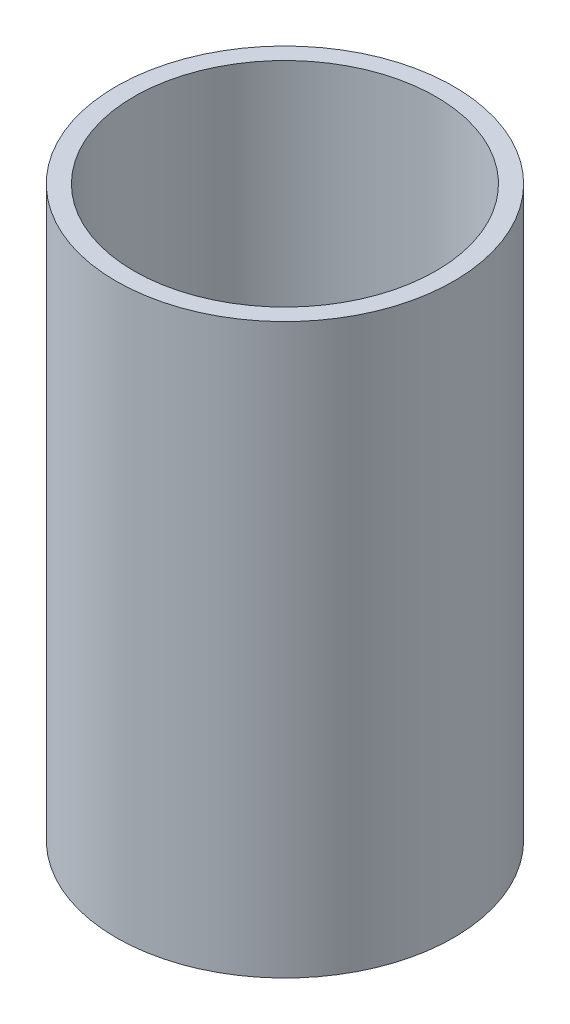
ISO-10303-21;
HEADER;
FILE_DESCRIPTION(('STEP AP214'),'2;1');
FILE_NAME('part.step','',(''),(''),'','','');
FILE_SCHEMA(('AUTOMOTIVE_DESIGN { 1 0 10303 214 1 1 1 1 }'));
ENDSEC;
DATA;
#1=APPLICATION_CONTEXT('core data for automotive mechanical design processes');
#2=APPLICATION_PROTOCOL_DEFINITION('international standard','automotive_design',2000,#1);
#3=PRODUCT_CONTEXT('',#1,'mechanical');
#4=PRODUCT('Part','Part','',(#3));
#5=PRODUCT_RELATED_PRODUCT_CATEGORY('part','',(#4));
#6=PRODUCT_DEFINITION_FORMATION('','',#4);
#7=PRODUCT_DEFINITION_CONTEXT('part definition',#1,'design');
#8=PRODUCT_DEFINITION('design','',#6,#7);
#9=PRODUCT_DEFINITION_SHAPE('','',#8);
#10=(LENGTH_UNIT() NAMED_UNIT(*) SI_UNIT(.MILLI.,.METRE.));
#11=(NAMED_UNIT(*) PLANE_ANGLE_UNIT() SI_UNIT($,.RADIAN.));
#12=(NAMED_UNIT(*) SI_UNIT($,.STERADIAN.) SOLID_ANGLE_UNIT());
#13=UNCERTAINTY_MEASURE_WITH_UNIT(LENGTH_MEASURE(1.E-05),#10,'distance_accuracy_value','');
#14=(GEOMETRIC_REPRESENTATION_CONTEXT(3) GLOBAL_UNCERTAINTY_ASSIGNED_CONTEXT((#13)) GLOBAL_UNIT_ASSIGNED_CONTEXT((#10,
#11,#12)) REPRESENTATION_CONTEXT('',''));
#15=CARTESIAN_POINT('',(0.,0.,0.));
#16=DIRECTION('',(0.,0.,1.));
#17=DIRECTION('',(1.,0.,0.));
#18=AXIS2_PLACEMENT_3D('',#15,#16,#17);
#19=CARTESIAN_POINT('',(0.,101.6,0.));
#20=DIRECTION('',(0.,1.,0.));
#21=DIRECTION('',(0.,0.,1.));
#22=AXIS2_PLACEMENT_3D('',#19,#20,#21);
#23=PLANE('',#22);
#24=CARTESIAN_POINT('',(0.,101.6,0.));
#25=DIRECTION('',(0.,1.,0.));
#26=DIRECTION('',(0.,0.,1.));
#27=AXIS2_PLACEMENT_3D('',#24,#25,#26);
#28=CIRCLE('',#27,30.1625);
#29=CARTESIAN_POINT('',(0.,101.6,30.1625));
#30=VERTEX_POINT('',#29);
#31=EDGE_CURVE('E10',#30,#30,#28,.T.);
#32=ORIENTED_EDGE('',*,*,#31,.T.);
#33=EDGE_LOOP('',(#32));
#34=FACE_BOUND('',#33,.T.);
#35=CARTESIAN_POINT('',(0.,101.6,0.));
#36=DIRECTION('',(0.,1.,0.));
#37=DIRECTION('',(0.,0.,1.));
#38=AXIS2_PLACEMENT_3D('',#35,#36,#37);
#39=CIRCLE('',#38,26.9875);
#40=CARTESIAN_POINT('',(0.,101.6,26.9875));
#41=VERTEX_POINT('',#40);
#42=EDGE_CURVE('E42',#41,#41,#39,.T.);
#43=ORIENTED_EDGE('',*,*,#42,.F.);
#44=EDGE_LOOP('',(#43));
#45=FACE_BOUND('',#44,.T.);
#46=ADVANCED_FACE('F31',(#34,#45),#23,.T.);
#47=CARTESIAN_POINT('',(0.,0.,0.));
#48=DIRECTION('',(0.,1.,0.));
#49=DIRECTION('',(0.,0.,1.));
#50=AXIS2_PLACEMENT_3D('',#47,#48,#49);
#51=PLANE('',#50);
#52=CARTESIAN_POINT('',(0.,0.,0.));
#53=DIRECTION('',(0.,1.,0.));
#54=DIRECTION('',(0.,0.,1.));
#55=AXIS2_PLACEMENT_3D('',#52,#53,#54);
#56=CIRCLE('',#55,30.1625);
#57=CARTESIAN_POINT('',(0.,0.,30.1625));
#58=VERTEX_POINT('',#57);
#59=EDGE_CURVE('E35',#58,#58,#56,.T.);
#60=ORIENTED_EDGE('',*,*,#59,.F.);
#61=EDGE_LOOP('',(#60));
#62=FACE_BOUND('',#61,.T.);
#63=CARTESIAN_POINT('',(0.,0.,0.));
#64=DIRECTION('',(0.,1.,0.));
#65=DIRECTION('',(0.,0.,1.));
#66=AXIS2_PLACEMENT_3D('',#63,#64,#65);
#67=CIRCLE('',#66,26.9875);
#68=CARTESIAN_POINT('',(0.,0.,26.9875));
#69=VERTEX_POINT('',#68);
#70=EDGE_CURVE('E44',#69,#69,#67,.T.);
#71=ORIENTED_EDGE('',*,*,#70,.T.);
#72=EDGE_LOOP('',(#71));
#73=FACE_BOUND('',#72,.T.);
#74=ADVANCED_FACE('F54',(#62,#73),#51,.F.);
#75=CARTESIAN_POINT('',(0.,101.6,0.));
#76=DIRECTION('',(0.,-1.,0.));
#77=DIRECTION('',(0.,0.,-1.));
#78=AXIS2_PLACEMENT_3D('',#75,#76,#77);
#79=CYLINDRICAL_SURFACE('',#78,30.1625);
#80=ORIENTED_EDGE('',*,*,#31,.F.);
#81=EDGE_LOOP('',(#80));
#82=FACE_BOUND('',#81,.T.);
#83=ORIENTED_EDGE('',*,*,#59,.T.);
#84=EDGE_LOOP('',(#83));
#85=FACE_BOUND('',#84,.T.);
#86=ADVANCED_FACE('F33',(#82,#85),#79,.T.);
#87=CARTESIAN_POINT('',(0.,101.6,0.));
#88=DIRECTION('',(0.,-1.,0.));
#89=DIRECTION('',(0.,0.,-1.));
#90=AXIS2_PLACEMENT_3D('',#87,#88,#89);
#91=CYLINDRICAL_SURFACE('',#90,26.9875);
#92=ORIENTED_EDGE('',*,*,#42,.T.);
#93=EDGE_LOOP('',(#92));
#94=FACE_BOUND('',#93,.T.);
#95=ORIENTED_EDGE('',*,*,#70,.F.);
#96=EDGE_LOOP('',(#95));
#97=FACE_BOUND('',#96,.T.);
#98=ADVANCED_FACE('F50',(#94,#97),#91,.F.);
#99=CLOSED_SHELL('',(#46,#74,#86,#98));
#100=MANIFOLD_SOLID_BREP('B2',#99);
#101=ADVANCED_BREP_SHAPE_REPRESENTATION('',(#18,#100),#14);
#102=SHAPE_DEFINITION_REPRESENTATION(#9,#101);
ENDSEC;
END-ISO-10303-21;
